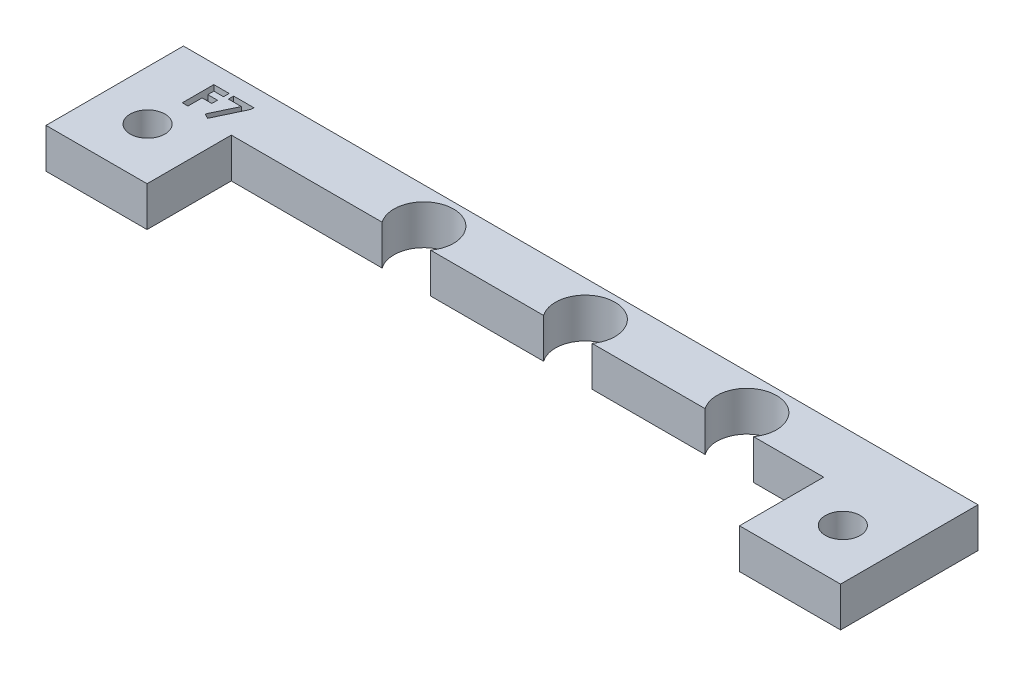
ISO-10303-21;
HEADER;
FILE_DESCRIPTION(('STEP AP214'),'2;1');
FILE_NAME('part.step','',(''),(''),'','','');
FILE_SCHEMA(('AUTOMOTIVE_DESIGN { 1 0 10303 214 1 1 1 1 }'));
ENDSEC;
DATA;
#1=APPLICATION_CONTEXT('core data for automotive mechanical design processes');
#2=APPLICATION_PROTOCOL_DEFINITION('international standard','automotive_design',2000,#1);
#3=PRODUCT_CONTEXT('',#1,'mechanical');
#4=PRODUCT('Part','Part','',(#3));
#5=PRODUCT_RELATED_PRODUCT_CATEGORY('part','',(#4));
#6=PRODUCT_DEFINITION_FORMATION('','',#4);
#7=PRODUCT_DEFINITION_CONTEXT('part definition',#1,'design');
#8=PRODUCT_DEFINITION('design','',#6,#7);
#9=PRODUCT_DEFINITION_SHAPE('','',#8);
#10=(LENGTH_UNIT() NAMED_UNIT(*) SI_UNIT(.MILLI.,.METRE.));
#11=(NAMED_UNIT(*) PLANE_ANGLE_UNIT() SI_UNIT($,.RADIAN.));
#12=(NAMED_UNIT(*) SI_UNIT($,.STERADIAN.) SOLID_ANGLE_UNIT());
#13=UNCERTAINTY_MEASURE_WITH_UNIT(LENGTH_MEASURE(1.E-05),#10,'distance_accuracy_value','');
#14=(GEOMETRIC_REPRESENTATION_CONTEXT(3) GLOBAL_UNCERTAINTY_ASSIGNED_CONTEXT((#13)) GLOBAL_UNIT_ASSIGNED_CONTEXT((#10,
#11,#12)) REPRESENTATION_CONTEXT('',''));
#15=CARTESIAN_POINT('',(0.,0.,0.));
#16=DIRECTION('',(0.,0.,1.));
#17=DIRECTION('',(1.,0.,0.));
#18=AXIS2_PLACEMENT_3D('',#15,#16,#17);
#19=CARTESIAN_POINT('',(0.,4.,0.));
#20=DIRECTION('',(0.,1.,0.));
#21=DIRECTION('',(0.,0.,1.));
#22=AXIS2_PLACEMENT_3D('',#19,#20,#21);
#23=PLANE('',#22);
#24=DIRECTION('',(1.,0.,0.));
#25=VECTOR('',#24,1.);
#26=CARTESIAN_POINT('',(0.,4.,10.3374425396582));
#27=LINE('',#26,#25);
#28=CARTESIAN_POINT('',(25.1964746150227,4.,10.3374425396582));
#29=VERTEX_POINT('',#28);
#30=CARTESIAN_POINT('',(36.5830777496134,4.,10.3374425396582));
#31=VERTEX_POINT('',#30);
#32=EDGE_CURVE('E355',#29,#31,#27,.T.);
#33=ORIENTED_EDGE('',*,*,#32,.T.);
#34=CARTESIAN_POINT('',(39.0197761823179,4.,8.58744232592804));
#35=DIRECTION('',(0.,1.,0.));
#36=DIRECTION('',(0.,0.,1.));
#37=AXIS2_PLACEMENT_3D('',#34,#35,#36);
#38=CIRCLE('',#37,3.);
#39=CARTESIAN_POINT('',(41.4564746150223,4.,10.3374425396582));
#40=VERTEX_POINT('',#39);
#41=EDGE_CURVE('E358',#40,#31,#38,.T.);
#42=ORIENTED_EDGE('',*,*,#41,.F.);
#43=DIRECTION('',(1.,0.,0.));
#44=VECTOR('',#43,1.);
#45=CARTESIAN_POINT('',(0.,4.,10.3374425396582));
#46=LINE('',#45,#44);
#47=CARTESIAN_POINT('',(48.5197761823179,4.,10.3374425396582));
#48=VERTEX_POINT('',#47);
#49=EDGE_CURVE('E363',#40,#48,#46,.T.);
#50=ORIENTED_EDGE('',*,*,#49,.T.);
#51=DIRECTION('',(0.,0.,-1.));
#52=VECTOR('',#51,1.);
#53=CARTESIAN_POINT('',(48.5197761823179,4.,0.));
#54=LINE('',#53,#52);
#55=CARTESIAN_POINT('',(48.5197761823179,4.,18.8163166195389));
#56=VERTEX_POINT('',#55);
#57=EDGE_CURVE('E366',#56,#48,#54,.T.);
#58=ORIENTED_EDGE('',*,*,#57,.F.);
#59=DIRECTION('',(1.,0.,0.));
#60=VECTOR('',#59,1.);
#61=CARTESIAN_POINT('',(0.,4.,18.8163166195389));
#62=LINE('',#61,#60);
#63=CARTESIAN_POINT('',(58.6947761823179,4.,18.8163166195389));
#64=VERTEX_POINT('',#63);
#65=EDGE_CURVE('E370',#56,#64,#62,.T.);
#66=ORIENTED_EDGE('',*,*,#65,.T.);
#67=DIRECTION('',(0.,0.,1.));
#68=VECTOR('',#67,1.);
#69=CARTESIAN_POINT('',(58.6947761823179,4.,0.));
#70=LINE('',#69,#68);
#71=CARTESIAN_POINT('',(58.6947761823179,4.,4.97792171139708));
#72=VERTEX_POINT('',#71);
#73=EDGE_CURVE('E373',#72,#64,#70,.T.);
#74=ORIENTED_EDGE('',*,*,#73,.F.);
#75=DIRECTION('',(1.,0.,0.));
#76=VECTOR('',#75,1.);
#77=CARTESIAN_POINT('',(0.,4.,4.97792171139708));
#78=LINE('',#77,#76);
#79=CARTESIAN_POINT('',(-21.3052238176821,4.,4.97792171139708));
#80=VERTEX_POINT('',#79);
#81=EDGE_CURVE('E377',#80,#72,#78,.T.);
#82=ORIENTED_EDGE('',*,*,#81,.F.);
#83=DIRECTION('',(0.,0.,-1.));
#84=VECTOR('',#83,1.);
#85=CARTESIAN_POINT('',(-21.3052238176821,4.,0.));
#86=LINE('',#85,#84);
#87=CARTESIAN_POINT('',(-21.3052238176821,4.,18.8163166195389));
#88=VERTEX_POINT('',#87);
#89=EDGE_CURVE('E381',#88,#80,#86,.T.);
#90=ORIENTED_EDGE('',*,*,#89,.F.);
#91=DIRECTION('',(1.,0.,0.));
#92=VECTOR('',#91,1.);
#93=CARTESIAN_POINT('',(0.,4.,18.8163166195389));
#94=LINE('',#93,#92);
#95=CARTESIAN_POINT('',(-11.1302238176834,4.,18.8163166195389));
#96=VERTEX_POINT('',#95);
#97=EDGE_CURVE('E385',#88,#96,#94,.T.);
#98=ORIENTED_EDGE('',*,*,#97,.T.);
#99=DIRECTION('',(0.,0.,1.));
#100=VECTOR('',#99,1.);
#101=CARTESIAN_POINT('',(-11.1302238176836,4.,0.));
#102=LINE('',#101,#100);
#103=CARTESIAN_POINT('',(-11.1302238176835,4.,10.3374425396582));
#104=VERTEX_POINT('',#103);
#105=EDGE_CURVE('E388',#104,#96,#102,.T.);
#106=ORIENTED_EDGE('',*,*,#105,.F.);
#107=DIRECTION('',(1.,0.,0.));
#108=VECTOR('',#107,1.);
#109=CARTESIAN_POINT('',(0.,4.,10.3374425396582));
#110=LINE('',#109,#108);
#111=CARTESIAN_POINT('',(4.06307774961151,4.,10.3374425396582));
#112=VERTEX_POINT('',#111);
#113=EDGE_CURVE('E392',#104,#112,#110,.T.);
#114=ORIENTED_EDGE('',*,*,#113,.T.);
#115=CARTESIAN_POINT('',(6.49977618231591,4.,8.58744232592797));
#116=DIRECTION('',(0.,1.,0.));
#117=DIRECTION('',(0.,0.,1.));
#118=AXIS2_PLACEMENT_3D('',#115,#116,#117);
#119=CIRCLE('',#118,3.);
#120=CARTESIAN_POINT('',(8.9364746150203,4.,10.3374425396582));
#121=VERTEX_POINT('',#120);
#122=EDGE_CURVE('E395',#121,#112,#119,.T.);
#123=ORIENTED_EDGE('',*,*,#122,.F.);
#124=DIRECTION('',(1.,0.,0.));
#125=VECTOR('',#124,1.);
#126=CARTESIAN_POINT('',(0.,4.,10.3374425396582));
#127=LINE('',#126,#125);
#128=CARTESIAN_POINT('',(20.3230777496139,4.,10.3374425396582));
#129=VERTEX_POINT('',#128);
#130=EDGE_CURVE('E399',#121,#129,#127,.T.);
#131=ORIENTED_EDGE('',*,*,#130,.T.);
#132=CARTESIAN_POINT('',(22.7597761823183,4.,8.58744232592797));
#133=DIRECTION('',(0.,1.,0.));
#134=DIRECTION('',(0.,0.,1.));
#135=AXIS2_PLACEMENT_3D('',#132,#133,#134);
#136=CIRCLE('',#135,3.);
#137=EDGE_CURVE('E402',#29,#129,#136,.T.);
#138=ORIENTED_EDGE('',*,*,#137,.F.);
#139=EDGE_LOOP('',(#33,#42,#50,#58,#66,#74,#82,#90,#98,#106,#114,#123,#131,#138));
#140=FACE_BOUND('',#139,.T.);
#141=CARTESIAN_POINT('',(53.6947761823179,4.,13.5874424327929));
#142=DIRECTION('',(0.,1.,0.));
#143=DIRECTION('',(0.,0.,1.));
#144=AXIS2_PLACEMENT_3D('',#141,#142,#143);
#145=CIRCLE('',#144,1.75);
#146=CARTESIAN_POINT('',(53.6947761823179,4.,15.3374424327929));
#147=VERTEX_POINT('',#146);
#148=EDGE_CURVE('E406',#147,#147,#145,.T.);
#149=ORIENTED_EDGE('',*,*,#148,.F.);
#150=EDGE_LOOP('',(#149));
#151=FACE_BOUND('',#150,.T.);
#152=CARTESIAN_POINT('',(-16.3052238176821,4.,13.587442432793));
#153=DIRECTION('',(0.,1.,0.));
#154=DIRECTION('',(0.,0.,1.));
#155=AXIS2_PLACEMENT_3D('',#152,#153,#154);
#156=CIRCLE('',#155,1.75);
#157=CARTESIAN_POINT('',(-16.3052238176821,4.,15.337442432793));
#158=VERTEX_POINT('',#157);
#159=EDGE_CURVE('E410',#158,#158,#156,.T.);
#160=ORIENTED_EDGE('',*,*,#159,.F.);
#161=EDGE_LOOP('',(#160));
#162=FACE_BOUND('',#161,.T.);
#163=DIRECTION('',(-1.,0.,0.));
#164=VECTOR('',#163,1.);
#165=CARTESIAN_POINT('',(-13.1174110061835,4.,7.3416332605224));
#166=LINE('',#165,#164);
#167=CARTESIAN_POINT('',(-13.1174110061835,4.,7.3416332605224));
#168=VERTEX_POINT('',#167);
#169=CARTESIAN_POINT('',(-14.4174310382347,4.,7.3416332605224));
#170=VERTEX_POINT('',#169);
#171=EDGE_CURVE('E308',#168,#170,#166,.T.);
#172=ORIENTED_EDGE('',*,*,#171,.T.);
#173=DIRECTION('',(0.,0.,-1.));
#174=VECTOR('',#173,1.);
#175=CARTESIAN_POINT('',(-14.4174310382347,4.,7.3416332605224));
#176=LINE('',#175,#174);
#177=CARTESIAN_POINT('',(-14.4174310382347,4.,6.81246659385574));
#178=VERTEX_POINT('',#177);
#179=EDGE_CURVE('E69',#170,#178,#176,.T.);
#180=ORIENTED_EDGE('',*,*,#179,.T.);
#181=DIRECTION('',(1.,0.,0.));
#182=VECTOR('',#181,1.);
#183=CARTESIAN_POINT('',(-14.4174310382347,4.,6.81246659385574));
#184=LINE('',#183,#182);
#185=CARTESIAN_POINT('',(-12.3821746279783,4.,6.81246659385574));
#186=VERTEX_POINT('',#185);
#187=EDGE_CURVE('E329',#178,#186,#184,.T.);
#188=ORIENTED_EDGE('',*,*,#187,.T.);
#189=DIRECTION('',(0.,0.,1.));
#190=VECTOR('',#189,1.);
#191=CARTESIAN_POINT('',(-12.3821746279783,4.,6.81246659385574));
#192=LINE('',#191,#190);
#193=CARTESIAN_POINT('',(-12.3821746279783,4.,7.10821479097112));
#194=VERTEX_POINT('',#193);
#195=EDGE_CURVE('E325',#186,#194,#192,.T.);
#196=ORIENTED_EDGE('',*,*,#195,.T.);
#197=DIRECTION('',(-0.427610471419761,0.,0.903963099209348));
#198=VECTOR('',#197,1.);
#199=CARTESIAN_POINT('',(-12.3821746279783,4.,7.10821479097112));
#200=LINE('',#199,#198);
#201=CARTESIAN_POINT('',(-13.782685445286,4.,10.068876850266));
#202=VERTEX_POINT('',#201);
#203=EDGE_CURVE('E321',#194,#202,#200,.T.);
#204=ORIENTED_EDGE('',*,*,#203,.T.);
#205=DIRECTION('',(-0.892845363411199,0.,-0.45036336111536));
#206=VECTOR('',#205,1.);
#207=CARTESIAN_POINT('',(-13.782685445286,4.,10.068876850266));
#208=LINE('',#207,#206);
#209=CARTESIAN_POINT('',(-14.2870474244527,4.,9.81446979898394));
#210=VERTEX_POINT('',#209);
#211=EDGE_CURVE('E317',#202,#210,#208,.T.);
#212=ORIENTED_EDGE('',*,*,#211,.T.);
#213=DIRECTION('',(0.427576554316682,0.,-0.903979142568386));
#214=VECTOR('',#213,1.);
#215=CARTESIAN_POINT('',(-14.2870474244527,4.,9.81446979898394));
#216=LINE('',#215,#214);
#217=EDGE_CURVE('E312',#210,#168,#216,.T.);
#218=ORIENTED_EDGE('',*,*,#217,.T.);
#219=EDGE_LOOP('',(#172,#180,#188,#196,#204,#212,#218));
#220=FACE_BOUND('',#219,.T.);
#221=DIRECTION('',(-1.,0.,0.));
#222=VECTOR('',#221,1.);
#223=CARTESIAN_POINT('',(-15.8421105254142,4.,9.98746659385574));
#224=LINE('',#223,#222);
#225=CARTESIAN_POINT('',(-15.8421105254142,4.,9.98746659385574));
#226=VERTEX_POINT('',#225);
#227=CARTESIAN_POINT('',(-16.411982320286,4.,9.98746659385574));
#228=VERTEX_POINT('',#227);
#229=EDGE_CURVE('E268',#226,#228,#224,.T.);
#230=ORIENTED_EDGE('',*,*,#229,.T.);
#231=DIRECTION('',(0.,0.,-1.));
#232=VECTOR('',#231,1.);
#233=CARTESIAN_POINT('',(-16.411982320286,4.,9.98746659385574));
#234=LINE('',#233,#232);
#235=CARTESIAN_POINT('',(-16.411982320286,4.,6.81246659385574));
#236=VERTEX_POINT('',#235);
#237=EDGE_CURVE('E61',#228,#236,#234,.T.);
#238=ORIENTED_EDGE('',*,*,#237,.T.);
#239=DIRECTION('',(1.,0.,0.));
#240=VECTOR('',#239,1.);
#241=CARTESIAN_POINT('',(-16.411982320286,4.,6.81246659385574));
#242=LINE('',#241,#240);
#243=CARTESIAN_POINT('',(-14.8651874484912,4.,6.81246659385574));
#244=VERTEX_POINT('',#243);
#245=EDGE_CURVE('E272',#236,#244,#242,.T.);
#246=ORIENTED_EDGE('',*,*,#245,.T.);
#247=DIRECTION('',(0.,0.,1.));
#248=VECTOR('',#247,1.);
#249=CARTESIAN_POINT('',(-14.8651874484912,4.,6.81246659385574));
#250=LINE('',#249,#248);
#251=CARTESIAN_POINT('',(-14.8651874484912,4.,7.38233838872753));
#252=VERTEX_POINT('',#251);
#253=EDGE_CURVE('E624',#244,#252,#250,.T.);
#254=ORIENTED_EDGE('',*,*,#253,.T.);
#255=DIRECTION('',(-1.,0.,0.));
#256=VECTOR('',#255,1.);
#257=CARTESIAN_POINT('',(-14.8651874484912,4.,7.38233838872753));
#258=LINE('',#257,#256);
#259=CARTESIAN_POINT('',(-15.8421105254142,4.,7.38233838872753));
#260=VERTEX_POINT('',#259);
#261=EDGE_CURVE('E627',#252,#260,#258,.T.);
#262=ORIENTED_EDGE('',*,*,#261,.T.);
#263=DIRECTION('',(0.,0.,1.));
#264=VECTOR('',#263,1.);
#265=CARTESIAN_POINT('',(-15.8421105254142,4.,7.38233838872753));
#266=LINE('',#265,#264);
#267=CARTESIAN_POINT('',(-15.8421105254142,4.,7.99291531180445));
#268=VERTEX_POINT('',#267);
#269=EDGE_CURVE('E633',#260,#268,#266,.T.);
#270=ORIENTED_EDGE('',*,*,#269,.T.);
#271=DIRECTION('',(1.,0.,0.));
#272=VECTOR('',#271,1.);
#273=CARTESIAN_POINT('',(-15.8421105254142,4.,7.99291531180445));
#274=LINE('',#273,#272);
#275=CARTESIAN_POINT('',(-14.8651874484912,4.,7.99291531180445));
#276=VERTEX_POINT('',#275);
#277=EDGE_CURVE('E643',#268,#276,#274,.T.);
#278=ORIENTED_EDGE('',*,*,#277,.T.);
#279=DIRECTION('',(0.,0.,1.));
#280=VECTOR('',#279,1.);
#281=CARTESIAN_POINT('',(-14.8651874484912,4.,7.99291531180445));
#282=LINE('',#281,#280);
#283=CARTESIAN_POINT('',(-14.8651874484912,4.,8.56278710667625));
#284=VERTEX_POINT('',#283);
#285=EDGE_CURVE('E647',#276,#284,#282,.T.);
#286=ORIENTED_EDGE('',*,*,#285,.T.);
#287=DIRECTION('',(-1.,0.,0.));
#288=VECTOR('',#287,1.);
#289=CARTESIAN_POINT('',(-14.8651874484912,4.,8.56278710667625));
#290=LINE('',#289,#288);
#291=CARTESIAN_POINT('',(-15.8421105254142,4.,8.56278710667625));
#292=VERTEX_POINT('',#291);
#293=EDGE_CURVE('E593',#284,#292,#290,.T.);
#294=ORIENTED_EDGE('',*,*,#293,.T.);
#295=DIRECTION('',(0.,0.,1.));
#296=VECTOR('',#295,1.);
#297=CARTESIAN_POINT('',(-15.8421105254142,4.,8.56278710667625));
#298=LINE('',#297,#296);
#299=EDGE_CURVE('E587',#292,#226,#298,.T.);
#300=ORIENTED_EDGE('',*,*,#299,.T.);
#301=EDGE_LOOP('',(#230,#238,#246,#254,#262,#270,#278,#286,#294,#300));
#302=FACE_BOUND('',#301,.T.);
#303=ADVANCED_FACE('F45',(#140,#151,#162,#220,#302),#23,.T.);
#304=CARTESIAN_POINT('',(0.,4.,10.3374425396582));
#305=DIRECTION('',(0.,0.,-1.));
#306=DIRECTION('',(-1.,0.,0.));
#307=AXIS2_PLACEMENT_3D('',#304,#305,#306);
#308=PLANE('',#307);
#309=DIRECTION('',(1.,0.,0.));
#310=VECTOR('',#309,1.);
#311=CARTESIAN_POINT('',(0.,0.,10.3374425396582));
#312=LINE('',#311,#310);
#313=CARTESIAN_POINT('',(25.1964746150227,0.,10.3374425396582));
#314=VERTEX_POINT('',#313);
#315=CARTESIAN_POINT('',(36.5830777496134,0.,10.3374425396582));
#316=VERTEX_POINT('',#315);
#317=EDGE_CURVE('E274',#314,#316,#312,.T.);
#318=ORIENTED_EDGE('',*,*,#317,.T.);
#319=DIRECTION('',(0.,-1.,0.));
#320=VECTOR('',#319,1.);
#321=CARTESIAN_POINT('',(36.5830777496134,4.,10.3374425396582));
#322=LINE('',#321,#320);
#323=EDGE_CURVE('E11',#31,#316,#322,.T.);
#324=ORIENTED_EDGE('',*,*,#323,.F.);
#325=ORIENTED_EDGE('',*,*,#32,.F.);
#326=DIRECTION('',(0.,-1.,0.));
#327=VECTOR('',#326,1.);
#328=CARTESIAN_POINT('',(25.1964746150227,4.,10.3374425396582));
#329=LINE('',#328,#327);
#330=EDGE_CURVE('E413',#29,#314,#329,.T.);
#331=ORIENTED_EDGE('',*,*,#330,.T.);
#332=EDGE_LOOP('',(#318,#324,#325,#331));
#333=FACE_BOUND('',#332,.T.);
#334=ADVANCED_FACE('F47',(#333),#308,.F.);
#335=CARTESIAN_POINT('',(39.0197761823179,4.,8.58744232592804));
#336=DIRECTION('',(0.,-1.,0.));
#337=DIRECTION('',(0.,0.,-1.));
#338=AXIS2_PLACEMENT_3D('',#335,#336,#337);
#339=CYLINDRICAL_SURFACE('',#338,3.);
#340=CARTESIAN_POINT('',(39.0197761823179,0.,8.58744232592804));
#341=DIRECTION('',(0.,1.,0.));
#342=DIRECTION('',(0.,0.,1.));
#343=AXIS2_PLACEMENT_3D('',#340,#341,#342);
#344=CIRCLE('',#343,3.);
#345=CARTESIAN_POINT('',(41.4564746150223,0.,10.3374425396582));
#346=VERTEX_POINT('',#345);
#347=EDGE_CURVE('E280',#346,#316,#344,.T.);
#348=ORIENTED_EDGE('',*,*,#347,.F.);
#349=DIRECTION('',(0.,-1.,0.));
#350=VECTOR('',#349,1.);
#351=CARTESIAN_POINT('',(41.4564746150223,4.,10.3374425396582));
#352=LINE('',#351,#350);
#353=EDGE_CURVE('E54',#40,#346,#352,.T.);
#354=ORIENTED_EDGE('',*,*,#353,.F.);
#355=ORIENTED_EDGE('',*,*,#41,.T.);
#356=ORIENTED_EDGE('',*,*,#323,.T.);
#357=EDGE_LOOP('',(#348,#354,#355,#356));
#358=FACE_BOUND('',#357,.T.);
#359=ADVANCED_FACE('F522',(#358),#339,.F.);
#360=CARTESIAN_POINT('',(0.,4.,10.3374425396582));
#361=DIRECTION('',(0.,0.,-1.));
#362=DIRECTION('',(-1.,0.,0.));
#363=AXIS2_PLACEMENT_3D('',#360,#361,#362);
#364=PLANE('',#363);
#365=DIRECTION('',(1.,0.,0.));
#366=VECTOR('',#365,1.);
#367=CARTESIAN_POINT('',(0.,0.,10.3374425396582));
#368=LINE('',#367,#366);
#369=CARTESIAN_POINT('',(48.5197761823179,0.,10.3374425396582));
#370=VERTEX_POINT('',#369);
#371=EDGE_CURVE('E418',#346,#370,#368,.T.);
#372=ORIENTED_EDGE('',*,*,#371,.T.);
#373=DIRECTION('',(0.,-1.,0.));
#374=VECTOR('',#373,1.);
#375=CARTESIAN_POINT('',(48.5197761823179,4.,10.3374425396582));
#376=LINE('',#375,#374);
#377=EDGE_CURVE('E505',#48,#370,#376,.T.);
#378=ORIENTED_EDGE('',*,*,#377,.F.);
#379=ORIENTED_EDGE('',*,*,#49,.F.);
#380=ORIENTED_EDGE('',*,*,#353,.T.);
#381=EDGE_LOOP('',(#372,#378,#379,#380));
#382=FACE_BOUND('',#381,.T.);
#383=ADVANCED_FACE('F511',(#382),#364,.F.);
#384=CARTESIAN_POINT('',(48.5197761823179,4.,0.));
#385=DIRECTION('',(-1.,0.,0.));
#386=DIRECTION('',(0.,0.,1.));
#387=AXIS2_PLACEMENT_3D('',#384,#385,#386);
#388=PLANE('',#387);
#389=DIRECTION('',(0.,0.,-1.));
#390=VECTOR('',#389,1.);
#391=CARTESIAN_POINT('',(48.5197761823179,0.,0.));
#392=LINE('',#391,#390);
#393=CARTESIAN_POINT('',(48.5197761823179,0.,18.8163166195389));
#394=VERTEX_POINT('',#393);
#395=EDGE_CURVE('E422',#394,#370,#392,.T.);
#396=ORIENTED_EDGE('',*,*,#395,.F.);
#397=DIRECTION('',(0.,-1.,0.));
#398=VECTOR('',#397,1.);
#399=CARTESIAN_POINT('',(48.5197761823179,4.,18.8163166195389));
#400=LINE('',#399,#398);
#401=EDGE_CURVE('E502',#56,#394,#400,.T.);
#402=ORIENTED_EDGE('',*,*,#401,.F.);
#403=ORIENTED_EDGE('',*,*,#57,.T.);
#404=ORIENTED_EDGE('',*,*,#377,.T.);
#405=EDGE_LOOP('',(#396,#402,#403,#404));
#406=FACE_BOUND('',#405,.T.);
#407=ADVANCED_FACE('F571',(#406),#388,.T.);
#408=CARTESIAN_POINT('',(0.,4.,18.8163166195389));
#409=DIRECTION('',(0.,0.,-1.));
#410=DIRECTION('',(-1.,0.,0.));
#411=AXIS2_PLACEMENT_3D('',#408,#409,#410);
#412=PLANE('',#411);
#413=DIRECTION('',(1.,0.,0.));
#414=VECTOR('',#413,1.);
#415=CARTESIAN_POINT('',(0.,0.,18.8163166195389));
#416=LINE('',#415,#414);
#417=CARTESIAN_POINT('',(58.6947761823179,0.,18.8163166195389));
#418=VERTEX_POINT('',#417);
#419=EDGE_CURVE('E426',#394,#418,#416,.T.);
#420=ORIENTED_EDGE('',*,*,#419,.T.);
#421=DIRECTION('',(0.,-1.,0.));
#422=VECTOR('',#421,1.);
#423=CARTESIAN_POINT('',(58.6947761823179,4.,18.8163166195389));
#424=LINE('',#423,#422);
#425=EDGE_CURVE('E499',#64,#418,#424,.T.);
#426=ORIENTED_EDGE('',*,*,#425,.F.);
#427=ORIENTED_EDGE('',*,*,#65,.F.);
#428=ORIENTED_EDGE('',*,*,#401,.T.);
#429=EDGE_LOOP('',(#420,#426,#427,#428));
#430=FACE_BOUND('',#429,.T.);
#431=ADVANCED_FACE('F568',(#430),#412,.F.);
#432=CARTESIAN_POINT('',(58.6947761823179,4.,0.));
#433=DIRECTION('',(1.,0.,0.));
#434=DIRECTION('',(0.,0.,-1.));
#435=AXIS2_PLACEMENT_3D('',#432,#433,#434);
#436=PLANE('',#435);
#437=DIRECTION('',(0.,0.,1.));
#438=VECTOR('',#437,1.);
#439=CARTESIAN_POINT('',(58.6947761823179,0.,0.));
#440=LINE('',#439,#438);
#441=CARTESIAN_POINT('',(58.6947761823179,0.,4.97792171139708));
#442=VERTEX_POINT('',#441);
#443=EDGE_CURVE('E430',#442,#418,#440,.T.);
#444=ORIENTED_EDGE('',*,*,#443,.F.);
#445=DIRECTION('',(0.,-1.,0.));
#446=VECTOR('',#445,1.);
#447=CARTESIAN_POINT('',(58.6947761823179,4.,4.97792171139708));
#448=LINE('',#447,#446);
#449=EDGE_CURVE('E496',#72,#442,#448,.T.);
#450=ORIENTED_EDGE('',*,*,#449,.F.);
#451=ORIENTED_EDGE('',*,*,#73,.T.);
#452=ORIENTED_EDGE('',*,*,#425,.T.);
#453=EDGE_LOOP('',(#444,#450,#451,#452));
#454=FACE_BOUND('',#453,.T.);
#455=ADVANCED_FACE('F563',(#454),#436,.T.);
#456=CARTESIAN_POINT('',(0.,4.,4.97792171139708));
#457=DIRECTION('',(0.,0.,-1.));
#458=DIRECTION('',(-1.,0.,0.));
#459=AXIS2_PLACEMENT_3D('',#456,#457,#458);
#460=PLANE('',#459);
#461=DIRECTION('',(1.,0.,0.));
#462=VECTOR('',#461,1.);
#463=CARTESIAN_POINT('',(0.,0.,4.97792171139708));
#464=LINE('',#463,#462);
#465=CARTESIAN_POINT('',(-21.3052238176821,0.,4.97792171139708));
#466=VERTEX_POINT('',#465);
#467=EDGE_CURVE('E434',#466,#442,#464,.T.);
#468=ORIENTED_EDGE('',*,*,#467,.F.);
#469=DIRECTION('',(0.,-1.,0.));
#470=VECTOR('',#469,1.);
#471=CARTESIAN_POINT('',(-21.3052238176821,4.,4.97792171139708));
#472=LINE('',#471,#470);
#473=EDGE_CURVE('E493',#80,#466,#472,.T.);
#474=ORIENTED_EDGE('',*,*,#473,.F.);
#475=ORIENTED_EDGE('',*,*,#81,.T.);
#476=ORIENTED_EDGE('',*,*,#449,.T.);
#477=EDGE_LOOP('',(#468,#474,#475,#476));
#478=FACE_BOUND('',#477,.T.);
#479=ADVANCED_FACE('F560',(#478),#460,.T.);
#480=CARTESIAN_POINT('',(-21.3052238176821,4.,0.));
#481=DIRECTION('',(-1.,0.,0.));
#482=DIRECTION('',(0.,0.,1.));
#483=AXIS2_PLACEMENT_3D('',#480,#481,#482);
#484=PLANE('',#483);
#485=DIRECTION('',(0.,0.,-1.));
#486=VECTOR('',#485,1.);
#487=CARTESIAN_POINT('',(-21.3052238176821,0.,0.));
#488=LINE('',#487,#486);
#489=CARTESIAN_POINT('',(-21.3052238176821,0.,18.8163166195389));
#490=VERTEX_POINT('',#489);
#491=EDGE_CURVE('E438',#490,#466,#488,.T.);
#492=ORIENTED_EDGE('',*,*,#491,.F.);
#493=DIRECTION('',(0.,-1.,0.));
#494=VECTOR('',#493,1.);
#495=CARTESIAN_POINT('',(-21.3052238176821,4.,18.8163166195389));
#496=LINE('',#495,#494);
#497=EDGE_CURVE('E490',#88,#490,#496,.T.);
#498=ORIENTED_EDGE('',*,*,#497,.F.);
#499=ORIENTED_EDGE('',*,*,#89,.T.);
#500=ORIENTED_EDGE('',*,*,#473,.T.);
#501=EDGE_LOOP('',(#492,#498,#499,#500));
#502=FACE_BOUND('',#501,.T.);
#503=ADVANCED_FACE('F555',(#502),#484,.T.);
#504=CARTESIAN_POINT('',(0.,4.,18.8163166195389));
#505=DIRECTION('',(0.,0.,-1.));
#506=DIRECTION('',(-1.,0.,0.));
#507=AXIS2_PLACEMENT_3D('',#504,#505,#506);
#508=PLANE('',#507);
#509=DIRECTION('',(1.,0.,0.));
#510=VECTOR('',#509,1.);
#511=CARTESIAN_POINT('',(0.,0.,18.8163166195389));
#512=LINE('',#511,#510);
#513=CARTESIAN_POINT('',(-11.1302238176834,0.,18.8163166195389));
#514=VERTEX_POINT('',#513);
#515=EDGE_CURVE('E442',#490,#514,#512,.T.);
#516=ORIENTED_EDGE('',*,*,#515,.T.);
#517=DIRECTION('',(0.,-1.,0.));
#518=VECTOR('',#517,1.);
#519=CARTESIAN_POINT('',(-11.1302238176834,4.,18.8163166195389));
#520=LINE('',#519,#518);
#521=EDGE_CURVE('E487',#96,#514,#520,.T.);
#522=ORIENTED_EDGE('',*,*,#521,.F.);
#523=ORIENTED_EDGE('',*,*,#97,.F.);
#524=ORIENTED_EDGE('',*,*,#497,.T.);
#525=EDGE_LOOP('',(#516,#522,#523,#524));
#526=FACE_BOUND('',#525,.T.);
#527=ADVANCED_FACE('F552',(#526),#508,.F.);
#528=CARTESIAN_POINT('',(-11.1302238176836,4.,0.));
#529=DIRECTION('',(1.,0.,0.));
#530=DIRECTION('',(0.,0.,-1.));
#531=AXIS2_PLACEMENT_3D('',#528,#529,#530);
#532=PLANE('',#531);
#533=DIRECTION('',(0.,0.,1.));
#534=VECTOR('',#533,1.);
#535=CARTESIAN_POINT('',(-11.1302238176836,0.,0.));
#536=LINE('',#535,#534);
#537=CARTESIAN_POINT('',(-11.1302238176835,0.,10.3374425396582));
#538=VERTEX_POINT('',#537);
#539=EDGE_CURVE('E446',#538,#514,#536,.T.);
#540=ORIENTED_EDGE('',*,*,#539,.F.);
#541=DIRECTION('',(0.,-1.,0.));
#542=VECTOR('',#541,1.);
#543=CARTESIAN_POINT('',(-11.1302238176835,4.,10.3374425396582));
#544=LINE('',#543,#542);
#545=EDGE_CURVE('E484',#104,#538,#544,.T.);
#546=ORIENTED_EDGE('',*,*,#545,.F.);
#547=ORIENTED_EDGE('',*,*,#105,.T.);
#548=ORIENTED_EDGE('',*,*,#521,.T.);
#549=EDGE_LOOP('',(#540,#546,#547,#548));
#550=FACE_BOUND('',#549,.T.);
#551=ADVANCED_FACE('F547',(#550),#532,.T.);
#552=CARTESIAN_POINT('',(0.,4.,10.3374425396582));
#553=DIRECTION('',(0.,0.,-1.));
#554=DIRECTION('',(-1.,0.,0.));
#555=AXIS2_PLACEMENT_3D('',#552,#553,#554);
#556=PLANE('',#555);
#557=DIRECTION('',(1.,0.,0.));
#558=VECTOR('',#557,1.);
#559=CARTESIAN_POINT('',(0.,0.,10.3374425396582));
#560=LINE('',#559,#558);
#561=CARTESIAN_POINT('',(4.06307774961151,0.,10.3374425396582));
#562=VERTEX_POINT('',#561);
#563=EDGE_CURVE('E450',#538,#562,#560,.T.);
#564=ORIENTED_EDGE('',*,*,#563,.T.);
#565=DIRECTION('',(0.,-1.,0.));
#566=VECTOR('',#565,1.);
#567=CARTESIAN_POINT('',(4.06307774961151,4.,10.3374425396582));
#568=LINE('',#567,#566);
#569=EDGE_CURVE('E481',#112,#562,#568,.T.);
#570=ORIENTED_EDGE('',*,*,#569,.F.);
#571=ORIENTED_EDGE('',*,*,#113,.F.);
#572=ORIENTED_EDGE('',*,*,#545,.T.);
#573=EDGE_LOOP('',(#564,#570,#571,#572));
#574=FACE_BOUND('',#573,.T.);
#575=ADVANCED_FACE('F543',(#574),#556,.F.);
#576=CARTESIAN_POINT('',(6.49977618231591,4.,8.58744232592797));
#577=DIRECTION('',(0.,-1.,0.));
#578=DIRECTION('',(0.,0.,-1.));
#579=AXIS2_PLACEMENT_3D('',#576,#577,#578);
#580=CYLINDRICAL_SURFACE('',#579,3.);
#581=CARTESIAN_POINT('',(6.49977618231591,0.,8.58744232592797));
#582=DIRECTION('',(0.,1.,0.));
#583=DIRECTION('',(0.,0.,1.));
#584=AXIS2_PLACEMENT_3D('',#581,#582,#583);
#585=CIRCLE('',#584,3.);
#586=CARTESIAN_POINT('',(8.9364746150203,0.,10.3374425396582));
#587=VERTEX_POINT('',#586);
#588=EDGE_CURVE('E454',#587,#562,#585,.T.);
#589=ORIENTED_EDGE('',*,*,#588,.F.);
#590=DIRECTION('',(0.,-1.,0.));
#591=VECTOR('',#590,1.);
#592=CARTESIAN_POINT('',(8.9364746150203,4.,10.3374425396582));
#593=LINE('',#592,#591);
#594=EDGE_CURVE('E478',#121,#587,#593,.T.);
#595=ORIENTED_EDGE('',*,*,#594,.F.);
#596=ORIENTED_EDGE('',*,*,#122,.T.);
#597=ORIENTED_EDGE('',*,*,#569,.T.);
#598=EDGE_LOOP('',(#589,#595,#596,#597));
#599=FACE_BOUND('',#598,.T.);
#600=ADVANCED_FACE('F538',(#599),#580,.F.);
#601=CARTESIAN_POINT('',(0.,4.,10.3374425396582));
#602=DIRECTION('',(0.,0.,-1.));
#603=DIRECTION('',(-1.,0.,0.));
#604=AXIS2_PLACEMENT_3D('',#601,#602,#603);
#605=PLANE('',#604);
#606=DIRECTION('',(1.,0.,0.));
#607=VECTOR('',#606,1.);
#608=CARTESIAN_POINT('',(0.,0.,10.3374425396582));
#609=LINE('',#608,#607);
#610=CARTESIAN_POINT('',(20.3230777496139,0.,10.3374425396582));
#611=VERTEX_POINT('',#610);
#612=EDGE_CURVE('E458',#587,#611,#609,.T.);
#613=ORIENTED_EDGE('',*,*,#612,.T.);
#614=DIRECTION('',(0.,-1.,0.));
#615=VECTOR('',#614,1.);
#616=CARTESIAN_POINT('',(20.3230777496139,4.,10.3374425396582));
#617=LINE('',#616,#615);
#618=EDGE_CURVE('E475',#129,#611,#617,.T.);
#619=ORIENTED_EDGE('',*,*,#618,.F.);
#620=ORIENTED_EDGE('',*,*,#130,.F.);
#621=ORIENTED_EDGE('',*,*,#594,.T.);
#622=EDGE_LOOP('',(#613,#619,#620,#621));
#623=FACE_BOUND('',#622,.T.);
#624=ADVANCED_FACE('F534',(#623),#605,.F.);
#625=CARTESIAN_POINT('',(53.6947761823179,4.,13.5874424327929));
#626=DIRECTION('',(0.,-1.,0.));
#627=DIRECTION('',(0.,0.,-1.));
#628=AXIS2_PLACEMENT_3D('',#625,#626,#627);
#629=CYLINDRICAL_SURFACE('',#628,1.75);
#630=ORIENTED_EDGE('',*,*,#148,.T.);
#631=EDGE_LOOP('',(#630));
#632=FACE_BOUND('',#631,.T.);
#633=CARTESIAN_POINT('',(53.6947761823179,0.,13.5874424327929));
#634=DIRECTION('',(0.,1.,0.));
#635=DIRECTION('',(0.,0.,1.));
#636=AXIS2_PLACEMENT_3D('',#633,#634,#635);
#637=CIRCLE('',#636,1.75);
#638=CARTESIAN_POINT('',(53.6947761823179,0.,15.3374424327929));
#639=VERTEX_POINT('',#638);
#640=EDGE_CURVE('E466',#639,#639,#637,.T.);
#641=ORIENTED_EDGE('',*,*,#640,.F.);
#642=EDGE_LOOP('',(#641));
#643=FACE_BOUND('',#642,.T.);
#644=ADVANCED_FACE('F754',(#632,#643),#629,.F.);
#645=CARTESIAN_POINT('',(22.7597761823183,4.,8.58744232592797));
#646=DIRECTION('',(0.,-1.,0.));
#647=DIRECTION('',(0.,0.,-1.));
#648=AXIS2_PLACEMENT_3D('',#645,#646,#647);
#649=CYLINDRICAL_SURFACE('',#648,3.);
#650=CARTESIAN_POINT('',(22.7597761823183,0.,8.58744232592797));
#651=DIRECTION('',(0.,1.,0.));
#652=DIRECTION('',(0.,0.,1.));
#653=AXIS2_PLACEMENT_3D('',#650,#651,#652);
#654=CIRCLE('',#653,3.);
#655=EDGE_CURVE('E462',#314,#611,#654,.T.);
#656=ORIENTED_EDGE('',*,*,#655,.F.);
#657=ORIENTED_EDGE('',*,*,#330,.F.);
#658=ORIENTED_EDGE('',*,*,#137,.T.);
#659=ORIENTED_EDGE('',*,*,#618,.T.);
#660=EDGE_LOOP('',(#656,#657,#658,#659));
#661=FACE_BOUND('',#660,.T.);
#662=ADVANCED_FACE('F529',(#661),#649,.F.);
#663=CARTESIAN_POINT('',(-16.3052238176821,4.,13.587442432793));
#664=DIRECTION('',(0.,-1.,0.));
#665=DIRECTION('',(0.,0.,-1.));
#666=AXIS2_PLACEMENT_3D('',#663,#664,#665);
#667=CYLINDRICAL_SURFACE('',#666,1.75);
#668=ORIENTED_EDGE('',*,*,#159,.T.);
#669=EDGE_LOOP('',(#668));
#670=FACE_BOUND('',#669,.T.);
#671=CARTESIAN_POINT('',(-16.3052238176821,0.,13.587442432793));
#672=DIRECTION('',(0.,1.,0.));
#673=DIRECTION('',(0.,0.,1.));
#674=AXIS2_PLACEMENT_3D('',#671,#672,#673);
#675=CIRCLE('',#674,1.75);
#676=CARTESIAN_POINT('',(-16.3052238176821,0.,15.337442432793));
#677=VERTEX_POINT('',#676);
#678=EDGE_CURVE('E359',#677,#677,#675,.T.);
#679=ORIENTED_EDGE('',*,*,#678,.F.);
#680=EDGE_LOOP('',(#679));
#681=FACE_BOUND('',#680,.T.);
#682=ADVANCED_FACE('F750',(#670,#681),#667,.F.);
#683=CARTESIAN_POINT('',(0.,0.,0.));
#684=DIRECTION('',(0.,1.,0.));
#685=DIRECTION('',(0.,0.,1.));
#686=AXIS2_PLACEMENT_3D('',#683,#684,#685);
#687=PLANE('',#686);
#688=ORIENTED_EDGE('',*,*,#317,.F.);
#689=ORIENTED_EDGE('',*,*,#655,.T.);
#690=ORIENTED_EDGE('',*,*,#612,.F.);
#691=ORIENTED_EDGE('',*,*,#588,.T.);
#692=ORIENTED_EDGE('',*,*,#563,.F.);
#693=ORIENTED_EDGE('',*,*,#539,.T.);
#694=ORIENTED_EDGE('',*,*,#515,.F.);
#695=ORIENTED_EDGE('',*,*,#491,.T.);
#696=ORIENTED_EDGE('',*,*,#467,.T.);
#697=ORIENTED_EDGE('',*,*,#443,.T.);
#698=ORIENTED_EDGE('',*,*,#419,.F.);
#699=ORIENTED_EDGE('',*,*,#395,.T.);
#700=ORIENTED_EDGE('',*,*,#371,.F.);
#701=ORIENTED_EDGE('',*,*,#347,.T.);
#702=EDGE_LOOP('',(#688,#689,#690,#691,#692,#693,#694,#695,#696,#697,#698,#699,#700,#701));
#703=FACE_BOUND('',#702,.T.);
#704=ORIENTED_EDGE('',*,*,#640,.T.);
#705=EDGE_LOOP('',(#704));
#706=FACE_BOUND('',#705,.T.);
#707=ORIENTED_EDGE('',*,*,#678,.T.);
#708=EDGE_LOOP('',(#707));
#709=FACE_BOUND('',#708,.T.);
#710=ADVANCED_FACE('F518',(#703,#706,#709),#687,.F.);
#711=CARTESIAN_POINT('',(-14.4174310382347,3.,7.3416332605224));
#712=DIRECTION('',(1.,0.,0.));
#713=DIRECTION('',(0.,0.,-1.));
#714=AXIS2_PLACEMENT_3D('',#711,#712,#713);
#715=PLANE('',#714);
#716=ORIENTED_EDGE('',*,*,#179,.F.);
#717=DIRECTION('',(0.,1.,0.));
#718=VECTOR('',#717,1.);
#719=CARTESIAN_POINT('',(-14.4174310382347,3.,7.3416332605224));
#720=LINE('',#719,#718);
#721=CARTESIAN_POINT('',(-14.4174310382347,3.,7.3416332605224));
#722=VERTEX_POINT('',#721);
#723=EDGE_CURVE('E304',#722,#170,#720,.T.);
#724=ORIENTED_EDGE('',*,*,#723,.F.);
#725=DIRECTION('',(0.,0.,-1.));
#726=VECTOR('',#725,1.);
#727=CARTESIAN_POINT('',(-14.4174310382347,3.,7.3416332605224));
#728=LINE('',#727,#726);
#729=CARTESIAN_POINT('',(-14.4174310382347,3.,6.81246659385574));
#730=VERTEX_POINT('',#729);
#731=EDGE_CURVE('E313',#722,#730,#728,.T.);
#732=ORIENTED_EDGE('',*,*,#731,.T.);
#733=DIRECTION('',(0.,1.,0.));
#734=VECTOR('',#733,1.);
#735=CARTESIAN_POINT('',(-14.4174310382347,3.,6.81246659385574));
#736=LINE('',#735,#734);
#737=EDGE_CURVE('E286',#730,#178,#736,.T.);
#738=ORIENTED_EDGE('',*,*,#737,.T.);
#739=EDGE_LOOP('',(#716,#724,#732,#738));
#740=FACE_BOUND('',#739,.T.);
#741=ADVANCED_FACE('F718',(#740),#715,.T.);
#742=CARTESIAN_POINT('',(-14.4174310382347,3.,6.81246659385574));
#743=DIRECTION('',(0.,0.,1.));
#744=DIRECTION('',(1.,0.,0.));
#745=AXIS2_PLACEMENT_3D('',#742,#743,#744);
#746=PLANE('',#745);
#747=ORIENTED_EDGE('',*,*,#187,.F.);
#748=ORIENTED_EDGE('',*,*,#737,.F.);
#749=DIRECTION('',(1.,0.,0.));
#750=VECTOR('',#749,1.);
#751=CARTESIAN_POINT('',(-14.4174310382347,3.,6.81246659385574));
#752=LINE('',#751,#750);
#753=CARTESIAN_POINT('',(-12.3821746279783,3.,6.81246659385574));
#754=VERTEX_POINT('',#753);
#755=EDGE_CURVE('E349',#730,#754,#752,.T.);
#756=ORIENTED_EDGE('',*,*,#755,.T.);
#757=DIRECTION('',(0.,1.,0.));
#758=VECTOR('',#757,1.);
#759=CARTESIAN_POINT('',(-12.3821746279783,3.,6.81246659385574));
#760=LINE('',#759,#758);
#761=EDGE_CURVE('E289',#754,#186,#760,.T.);
#762=ORIENTED_EDGE('',*,*,#761,.T.);
#763=EDGE_LOOP('',(#747,#748,#756,#762));
#764=FACE_BOUND('',#763,.T.);
#765=ADVANCED_FACE('F721',(#764),#746,.T.);
#766=CARTESIAN_POINT('',(-12.3821746279783,3.,6.81246659385574));
#767=DIRECTION('',(-1.,0.,0.));
#768=DIRECTION('',(0.,0.,1.));
#769=AXIS2_PLACEMENT_3D('',#766,#767,#768);
#770=PLANE('',#769);
#771=ORIENTED_EDGE('',*,*,#195,.F.);
#772=ORIENTED_EDGE('',*,*,#761,.F.);
#773=DIRECTION('',(0.,0.,1.));
#774=VECTOR('',#773,1.);
#775=CARTESIAN_POINT('',(-12.3821746279783,3.,6.81246659385574));
#776=LINE('',#775,#774);
#777=CARTESIAN_POINT('',(-12.3821746279783,3.,7.10821479097112));
#778=VERTEX_POINT('',#777);
#779=EDGE_CURVE('E346',#754,#778,#776,.T.);
#780=ORIENTED_EDGE('',*,*,#779,.T.);
#781=DIRECTION('',(0.,1.,0.));
#782=VECTOR('',#781,1.);
#783=CARTESIAN_POINT('',(-12.3821746279783,3.,7.10821479097112));
#784=LINE('',#783,#782);
#785=EDGE_CURVE('E292',#778,#194,#784,.T.);
#786=ORIENTED_EDGE('',*,*,#785,.T.);
#787=EDGE_LOOP('',(#771,#772,#780,#786));
#788=FACE_BOUND('',#787,.T.);
#789=ADVANCED_FACE('F724',(#788),#770,.T.);
#790=CARTESIAN_POINT('',(-12.3821746279783,3.,7.10821479097112));
#791=DIRECTION('',(-0.903963099209348,0.,-0.427610471419761));
#792=DIRECTION('',(-0.427610471419761,0.,0.903963099209348));
#793=AXIS2_PLACEMENT_3D('',#790,#791,#792);
#794=PLANE('',#793);
#795=ORIENTED_EDGE('',*,*,#203,.F.);
#796=ORIENTED_EDGE('',*,*,#785,.F.);
#797=DIRECTION('',(-0.427610471419761,0.,0.903963099209348));
#798=VECTOR('',#797,1.);
#799=CARTESIAN_POINT('',(-12.3821746279783,3.,7.10821479097112));
#800=LINE('',#799,#798);
#801=CARTESIAN_POINT('',(-13.782685445286,3.,10.068876850266));
#802=VERTEX_POINT('',#801);
#803=EDGE_CURVE('E343',#778,#802,#800,.T.);
#804=ORIENTED_EDGE('',*,*,#803,.T.);
#805=DIRECTION('',(0.,1.,0.));
#806=VECTOR('',#805,1.);
#807=CARTESIAN_POINT('',(-13.782685445286,3.,10.068876850266));
#808=LINE('',#807,#806);
#809=EDGE_CURVE('E295',#802,#202,#808,.T.);
#810=ORIENTED_EDGE('',*,*,#809,.T.);
#811=EDGE_LOOP('',(#795,#796,#804,#810));
#812=FACE_BOUND('',#811,.T.);
#813=ADVANCED_FACE('F728',(#812),#794,.T.);
#814=CARTESIAN_POINT('',(-13.782685445286,3.,10.068876850266));
#815=DIRECTION('',(0.45036336111536,0.,-0.892845363411199));
#816=DIRECTION('',(-0.892845363411199,0.,-0.45036336111536));
#817=AXIS2_PLACEMENT_3D('',#814,#815,#816);
#818=PLANE('',#817);
#819=ORIENTED_EDGE('',*,*,#211,.F.);
#820=ORIENTED_EDGE('',*,*,#809,.F.);
#821=DIRECTION('',(-0.892845363411199,0.,-0.45036336111536));
#822=VECTOR('',#821,1.);
#823=CARTESIAN_POINT('',(-13.782685445286,3.,10.068876850266));
#824=LINE('',#823,#822);
#825=CARTESIAN_POINT('',(-14.2870474244527,3.,9.81446979898394));
#826=VERTEX_POINT('',#825);
#827=EDGE_CURVE('E340',#802,#826,#824,.T.);
#828=ORIENTED_EDGE('',*,*,#827,.T.);
#829=DIRECTION('',(0.,1.,0.));
#830=VECTOR('',#829,1.);
#831=CARTESIAN_POINT('',(-14.2870474244527,3.,9.81446979898394));
#832=LINE('',#831,#830);
#833=EDGE_CURVE('E298',#826,#210,#832,.T.);
#834=ORIENTED_EDGE('',*,*,#833,.T.);
#835=EDGE_LOOP('',(#819,#820,#828,#834));
#836=FACE_BOUND('',#835,.T.);
#837=ADVANCED_FACE('F732',(#836),#818,.T.);
#838=CARTESIAN_POINT('',(-14.2870474244527,3.,9.81446979898394));
#839=DIRECTION('',(0.903979142568386,0.,0.427576554316682));
#840=DIRECTION('',(0.427576554316682,0.,-0.903979142568386));
#841=AXIS2_PLACEMENT_3D('',#838,#839,#840);
#842=PLANE('',#841);
#843=ORIENTED_EDGE('',*,*,#217,.F.);
#844=ORIENTED_EDGE('',*,*,#833,.F.);
#845=DIRECTION('',(0.427576554316682,0.,-0.903979142568386));
#846=VECTOR('',#845,1.);
#847=CARTESIAN_POINT('',(-14.2870474244527,3.,9.81446979898394));
#848=LINE('',#847,#846);
#849=CARTESIAN_POINT('',(-13.1174110061835,3.,7.3416332605224));
#850=VERTEX_POINT('',#849);
#851=EDGE_CURVE('E337',#826,#850,#848,.T.);
#852=ORIENTED_EDGE('',*,*,#851,.T.);
#853=DIRECTION('',(0.,1.,0.));
#854=VECTOR('',#853,1.);
#855=CARTESIAN_POINT('',(-13.1174110061835,3.,7.3416332605224));
#856=LINE('',#855,#854);
#857=EDGE_CURVE('E301',#850,#168,#856,.T.);
#858=ORIENTED_EDGE('',*,*,#857,.T.);
#859=EDGE_LOOP('',(#843,#844,#852,#858));
#860=FACE_BOUND('',#859,.T.);
#861=ADVANCED_FACE('F736',(#860),#842,.T.);
#862=CARTESIAN_POINT('',(-13.1174110061835,3.,7.3416332605224));
#863=DIRECTION('',(0.,0.,-1.));
#864=DIRECTION('',(-1.,0.,0.));
#865=AXIS2_PLACEMENT_3D('',#862,#863,#864);
#866=PLANE('',#865);
#867=ORIENTED_EDGE('',*,*,#171,.F.);
#868=ORIENTED_EDGE('',*,*,#857,.F.);
#869=DIRECTION('',(-1.,0.,0.));
#870=VECTOR('',#869,1.);
#871=CARTESIAN_POINT('',(-13.1174110061835,3.,7.3416332605224));
#872=LINE('',#871,#870);
#873=EDGE_CURVE('E307',#850,#722,#872,.T.);
#874=ORIENTED_EDGE('',*,*,#873,.T.);
#875=ORIENTED_EDGE('',*,*,#723,.T.);
#876=EDGE_LOOP('',(#867,#868,#874,#875));
#877=FACE_BOUND('',#876,.T.);
#878=ADVANCED_FACE('F740',(#877),#866,.T.);
#879=CARTESIAN_POINT('',(0.,3.,0.));
#880=DIRECTION('',(0.,-1.,0.));
#881=DIRECTION('',(0.,0.,-1.));
#882=AXIS2_PLACEMENT_3D('',#879,#880,#881);
#883=PLANE('',#882);
#884=ORIENTED_EDGE('',*,*,#731,.F.);
#885=ORIENTED_EDGE('',*,*,#873,.F.);
#886=ORIENTED_EDGE('',*,*,#851,.F.);
#887=ORIENTED_EDGE('',*,*,#827,.F.);
#888=ORIENTED_EDGE('',*,*,#803,.F.);
#889=ORIENTED_EDGE('',*,*,#779,.F.);
#890=ORIENTED_EDGE('',*,*,#755,.F.);
#891=EDGE_LOOP('',(#884,#885,#886,#887,#888,#889,#890));
#892=FACE_BOUND('',#891,.T.);
#893=ADVANCED_FACE('F717',(#892),#883,.F.);
#894=CARTESIAN_POINT('',(-16.411982320286,3.,9.98746659385574));
#895=DIRECTION('',(1.,0.,0.));
#896=DIRECTION('',(0.,0.,-1.));
#897=AXIS2_PLACEMENT_3D('',#894,#895,#896);
#898=PLANE('',#897);
#899=ORIENTED_EDGE('',*,*,#237,.F.);
#900=DIRECTION('',(0.,1.,0.));
#901=VECTOR('',#900,1.);
#902=CARTESIAN_POINT('',(-16.411982320286,3.,9.98746659385574));
#903=LINE('',#902,#901);
#904=CARTESIAN_POINT('',(-16.411982320286,3.,9.98746659385574));
#905=VERTEX_POINT('',#904);
#906=EDGE_CURVE('E266',#905,#228,#903,.T.);
#907=ORIENTED_EDGE('',*,*,#906,.F.);
#908=DIRECTION('',(0.,0.,-1.));
#909=VECTOR('',#908,1.);
#910=CARTESIAN_POINT('',(-16.411982320286,3.,9.98746659385574));
#911=LINE('',#910,#909);
#912=CARTESIAN_POINT('',(-16.411982320286,3.,6.81246659385574));
#913=VERTEX_POINT('',#912);
#914=EDGE_CURVE('E256',#905,#913,#911,.T.);
#915=ORIENTED_EDGE('',*,*,#914,.T.);
#916=DIRECTION('',(0.,1.,0.));
#917=VECTOR('',#916,1.);
#918=CARTESIAN_POINT('',(-16.411982320286,3.,6.81246659385574));
#919=LINE('',#918,#917);
#920=EDGE_CURVE('E265',#913,#236,#919,.T.);
#921=ORIENTED_EDGE('',*,*,#920,.T.);
#922=EDGE_LOOP('',(#899,#907,#915,#921));
#923=FACE_BOUND('',#922,.T.);
#924=ADVANCED_FACE('F264',(#923),#898,.T.);
#925=CARTESIAN_POINT('',(-16.411982320286,3.,6.81246659385574));
#926=DIRECTION('',(0.,0.,1.));
#927=DIRECTION('',(1.,0.,0.));
#928=AXIS2_PLACEMENT_3D('',#925,#926,#927);
#929=PLANE('',#928);
#930=ORIENTED_EDGE('',*,*,#245,.F.);
#931=ORIENTED_EDGE('',*,*,#920,.F.);
#932=DIRECTION('',(1.,0.,0.));
#933=VECTOR('',#932,1.);
#934=CARTESIAN_POINT('',(-16.411982320286,3.,6.81246659385574));
#935=LINE('',#934,#933);
#936=CARTESIAN_POINT('',(-14.8651874484912,3.,6.81246659385574));
#937=VERTEX_POINT('',#936);
#938=EDGE_CURVE('E252',#913,#937,#935,.T.);
#939=ORIENTED_EDGE('',*,*,#938,.T.);
#940=DIRECTION('',(0.,1.,0.));
#941=VECTOR('',#940,1.);
#942=CARTESIAN_POINT('',(-14.8651874484912,3.,6.81246659385574));
#943=LINE('',#942,#941);
#944=EDGE_CURVE('E275',#937,#244,#943,.T.);
#945=ORIENTED_EDGE('',*,*,#944,.T.);
#946=EDGE_LOOP('',(#930,#931,#939,#945));
#947=FACE_BOUND('',#946,.T.);
#948=ADVANCED_FACE('F270',(#947),#929,.T.);
#949=CARTESIAN_POINT('',(-14.8651874484912,3.,6.81246659385574));
#950=DIRECTION('',(-1.,0.,0.));
#951=DIRECTION('',(0.,0.,1.));
#952=AXIS2_PLACEMENT_3D('',#949,#950,#951);
#953=PLANE('',#952);
#954=ORIENTED_EDGE('',*,*,#253,.F.);
#955=ORIENTED_EDGE('',*,*,#944,.F.);
#956=DIRECTION('',(0.,0.,1.));
#957=VECTOR('',#956,1.);
#958=CARTESIAN_POINT('',(-14.8651874484912,3.,6.81246659385574));
#959=LINE('',#958,#957);
#960=CARTESIAN_POINT('',(-14.8651874484912,3.,7.38233838872753));
#961=VERTEX_POINT('',#960);
#962=EDGE_CURVE('E258',#937,#961,#959,.T.);
#963=ORIENTED_EDGE('',*,*,#962,.T.);
#964=DIRECTION('',(0.,1.,0.));
#965=VECTOR('',#964,1.);
#966=CARTESIAN_POINT('',(-14.8651874484912,3.,7.38233838872753));
#967=LINE('',#966,#965);
#968=EDGE_CURVE('E282',#961,#252,#967,.T.);
#969=ORIENTED_EDGE('',*,*,#968,.T.);
#970=EDGE_LOOP('',(#954,#955,#963,#969));
#971=FACE_BOUND('',#970,.T.);
#972=ADVANCED_FACE('F622',(#971),#953,.T.);
#973=CARTESIAN_POINT('',(-14.8651874484912,3.,7.38233838872753));
#974=DIRECTION('',(0.,0.,-1.));
#975=DIRECTION('',(-1.,0.,0.));
#976=AXIS2_PLACEMENT_3D('',#973,#974,#975);
#977=PLANE('',#976);
#978=ORIENTED_EDGE('',*,*,#261,.F.);
#979=ORIENTED_EDGE('',*,*,#968,.F.);
#980=DIRECTION('',(-1.,0.,0.));
#981=VECTOR('',#980,1.);
#982=CARTESIAN_POINT('',(-14.8651874484912,3.,7.38233838872753));
#983=LINE('',#982,#981);
#984=CARTESIAN_POINT('',(-15.8421105254142,3.,7.38233838872753));
#985=VERTEX_POINT('',#984);
#986=EDGE_CURVE('E681',#961,#985,#983,.T.);
#987=ORIENTED_EDGE('',*,*,#986,.T.);
#988=DIRECTION('',(0.,1.,0.));
#989=VECTOR('',#988,1.);
#990=CARTESIAN_POINT('',(-15.8421105254142,3.,7.38233838872753));
#991=LINE('',#990,#989);
#992=EDGE_CURVE('E615',#985,#260,#991,.T.);
#993=ORIENTED_EDGE('',*,*,#992,.T.);
#994=EDGE_LOOP('',(#978,#979,#987,#993));
#995=FACE_BOUND('',#994,.T.);
#996=ADVANCED_FACE('F628',(#995),#977,.T.);
#997=CARTESIAN_POINT('',(-15.8421105254142,3.,7.38233838872753));
#998=DIRECTION('',(-1.,0.,0.));
#999=DIRECTION('',(0.,0.,1.));
#1000=AXIS2_PLACEMENT_3D('',#997,#998,#999);
#1001=PLANE('',#1000);
#1002=ORIENTED_EDGE('',*,*,#269,.F.);
#1003=ORIENTED_EDGE('',*,*,#992,.F.);
#1004=DIRECTION('',(0.,0.,1.));
#1005=VECTOR('',#1004,1.);
#1006=CARTESIAN_POINT('',(-15.8421105254142,3.,7.38233838872753));
#1007=LINE('',#1006,#1005);
#1008=CARTESIAN_POINT('',(-15.8421105254142,3.,7.99291531180445));
#1009=VERTEX_POINT('',#1008);
#1010=EDGE_CURVE('E678',#985,#1009,#1007,.T.);
#1011=ORIENTED_EDGE('',*,*,#1010,.T.);
#1012=DIRECTION('',(0.,1.,0.));
#1013=VECTOR('',#1012,1.);
#1014=CARTESIAN_POINT('',(-15.8421105254142,3.,7.99291531180445));
#1015=LINE('',#1014,#1013);
#1016=EDGE_CURVE('E612',#1009,#268,#1015,.T.);
#1017=ORIENTED_EDGE('',*,*,#1016,.T.);
#1018=EDGE_LOOP('',(#1002,#1003,#1011,#1017));
#1019=FACE_BOUND('',#1018,.T.);
#1020=ADVANCED_FACE('F687',(#1019),#1001,.T.);
#1021=CARTESIAN_POINT('',(-15.8421105254142,3.,7.99291531180445));
#1022=DIRECTION('',(0.,0.,1.));
#1023=DIRECTION('',(1.,0.,0.));
#1024=AXIS2_PLACEMENT_3D('',#1021,#1022,#1023);
#1025=PLANE('',#1024);
#1026=ORIENTED_EDGE('',*,*,#277,.F.);
#1027=ORIENTED_EDGE('',*,*,#1016,.F.);
#1028=DIRECTION('',(1.,0.,0.));
#1029=VECTOR('',#1028,1.);
#1030=CARTESIAN_POINT('',(-15.8421105254142,3.,7.99291531180445));
#1031=LINE('',#1030,#1029);
#1032=CARTESIAN_POINT('',(-14.8651874484912,3.,7.99291531180445));
#1033=VERTEX_POINT('',#1032);
#1034=EDGE_CURVE('E675',#1009,#1033,#1031,.T.);
#1035=ORIENTED_EDGE('',*,*,#1034,.T.);
#1036=DIRECTION('',(0.,1.,0.));
#1037=VECTOR('',#1036,1.);
#1038=CARTESIAN_POINT('',(-14.8651874484912,3.,7.99291531180445));
#1039=LINE('',#1038,#1037);
#1040=EDGE_CURVE('E609',#1033,#276,#1039,.T.);
#1041=ORIENTED_EDGE('',*,*,#1040,.T.);
#1042=EDGE_LOOP('',(#1026,#1027,#1035,#1041));
#1043=FACE_BOUND('',#1042,.T.);
#1044=ADVANCED_FACE('F694',(#1043),#1025,.T.);
#1045=CARTESIAN_POINT('',(-14.8651874484912,3.,7.99291531180445));
#1046=DIRECTION('',(-1.,0.,0.));
#1047=DIRECTION('',(0.,0.,1.));
#1048=AXIS2_PLACEMENT_3D('',#1045,#1046,#1047);
#1049=PLANE('',#1048);
#1050=ORIENTED_EDGE('',*,*,#285,.F.);
#1051=ORIENTED_EDGE('',*,*,#1040,.F.);
#1052=DIRECTION('',(0.,0.,1.));
#1053=VECTOR('',#1052,1.);
#1054=CARTESIAN_POINT('',(-14.8651874484912,3.,7.99291531180445));
#1055=LINE('',#1054,#1053);
#1056=CARTESIAN_POINT('',(-14.8651874484912,3.,8.56278710667625));
#1057=VERTEX_POINT('',#1056);
#1058=EDGE_CURVE('E672',#1033,#1057,#1055,.T.);
#1059=ORIENTED_EDGE('',*,*,#1058,.T.);
#1060=DIRECTION('',(0.,1.,0.));
#1061=VECTOR('',#1060,1.);
#1062=CARTESIAN_POINT('',(-14.8651874484912,3.,8.56278710667625));
#1063=LINE('',#1062,#1061);
#1064=EDGE_CURVE('E606',#1057,#284,#1063,.T.);
#1065=ORIENTED_EDGE('',*,*,#1064,.T.);
#1066=EDGE_LOOP('',(#1050,#1051,#1059,#1065));
#1067=FACE_BOUND('',#1066,.T.);
#1068=ADVANCED_FACE('F696',(#1067),#1049,.T.);
#1069=CARTESIAN_POINT('',(-14.8651874484912,3.,8.56278710667625));
#1070=DIRECTION('',(0.,0.,-1.));
#1071=DIRECTION('',(-1.,0.,0.));
#1072=AXIS2_PLACEMENT_3D('',#1069,#1070,#1071);
#1073=PLANE('',#1072);
#1074=ORIENTED_EDGE('',*,*,#293,.F.);
#1075=ORIENTED_EDGE('',*,*,#1064,.F.);
#1076=DIRECTION('',(-1.,0.,0.));
#1077=VECTOR('',#1076,1.);
#1078=CARTESIAN_POINT('',(-14.8651874484912,3.,8.56278710667625));
#1079=LINE('',#1078,#1077);
#1080=CARTESIAN_POINT('',(-15.8421105254142,3.,8.56278710667625));
#1081=VERTEX_POINT('',#1080);
#1082=EDGE_CURVE('E658',#1057,#1081,#1079,.T.);
#1083=ORIENTED_EDGE('',*,*,#1082,.T.);
#1084=DIRECTION('',(0.,1.,0.));
#1085=VECTOR('',#1084,1.);
#1086=CARTESIAN_POINT('',(-15.8421105254142,3.,8.56278710667625));
#1087=LINE('',#1086,#1085);
#1088=EDGE_CURVE('E603',#1081,#292,#1087,.T.);
#1089=ORIENTED_EDGE('',*,*,#1088,.T.);
#1090=EDGE_LOOP('',(#1074,#1075,#1083,#1089));
#1091=FACE_BOUND('',#1090,.T.);
#1092=ADVANCED_FACE('F655',(#1091),#1073,.T.);
#1093=CARTESIAN_POINT('',(-15.8421105254142,3.,8.56278710667625));
#1094=DIRECTION('',(-1.,0.,0.));
#1095=DIRECTION('',(0.,0.,1.));
#1096=AXIS2_PLACEMENT_3D('',#1093,#1094,#1095);
#1097=PLANE('',#1096);
#1098=ORIENTED_EDGE('',*,*,#299,.F.);
#1099=ORIENTED_EDGE('',*,*,#1088,.F.);
#1100=DIRECTION('',(0.,0.,1.));
#1101=VECTOR('',#1100,1.);
#1102=CARTESIAN_POINT('',(-15.8421105254142,3.,8.56278710667625));
#1103=LINE('',#1102,#1101);
#1104=CARTESIAN_POINT('',(-15.8421105254142,3.,9.98746659385574));
#1105=VERTEX_POINT('',#1104);
#1106=EDGE_CURVE('E662',#1081,#1105,#1103,.T.);
#1107=ORIENTED_EDGE('',*,*,#1106,.T.);
#1108=DIRECTION('',(0.,1.,0.));
#1109=VECTOR('',#1108,1.);
#1110=CARTESIAN_POINT('',(-15.8421105254142,3.,9.98746659385574));
#1111=LINE('',#1110,#1109);
#1112=EDGE_CURVE('E599',#1105,#226,#1111,.T.);
#1113=ORIENTED_EDGE('',*,*,#1112,.T.);
#1114=EDGE_LOOP('',(#1098,#1099,#1107,#1113));
#1115=FACE_BOUND('',#1114,.T.);
#1116=ADVANCED_FACE('F661',(#1115),#1097,.T.);
#1117=CARTESIAN_POINT('',(-15.8421105254142,3.,9.98746659385574));
#1118=DIRECTION('',(0.,0.,-1.));
#1119=DIRECTION('',(-1.,0.,0.));
#1120=AXIS2_PLACEMENT_3D('',#1117,#1118,#1119);
#1121=PLANE('',#1120);
#1122=ORIENTED_EDGE('',*,*,#229,.F.);
#1123=ORIENTED_EDGE('',*,*,#1112,.F.);
#1124=DIRECTION('',(-1.,0.,0.));
#1125=VECTOR('',#1124,1.);
#1126=CARTESIAN_POINT('',(-15.8421105254142,3.,9.98746659385574));
#1127=LINE('',#1126,#1125);
#1128=EDGE_CURVE('E600',#1105,#905,#1127,.T.);
#1129=ORIENTED_EDGE('',*,*,#1128,.T.);
#1130=ORIENTED_EDGE('',*,*,#906,.T.);
#1131=EDGE_LOOP('',(#1122,#1123,#1129,#1130));
#1132=FACE_BOUND('',#1131,.T.);
#1133=ADVANCED_FACE('F663',(#1132),#1121,.T.);
#1134=CARTESIAN_POINT('',(0.,3.,0.));
#1135=DIRECTION('',(0.,-1.,0.));
#1136=DIRECTION('',(0.,0.,-1.));
#1137=AXIS2_PLACEMENT_3D('',#1134,#1135,#1136);
#1138=PLANE('',#1137);
#1139=ORIENTED_EDGE('',*,*,#914,.F.);
#1140=ORIENTED_EDGE('',*,*,#1128,.F.);
#1141=ORIENTED_EDGE('',*,*,#1106,.F.);
#1142=ORIENTED_EDGE('',*,*,#1082,.F.);
#1143=ORIENTED_EDGE('',*,*,#1058,.F.);
#1144=ORIENTED_EDGE('',*,*,#1034,.F.);
#1145=ORIENTED_EDGE('',*,*,#1010,.F.);
#1146=ORIENTED_EDGE('',*,*,#986,.F.);
#1147=ORIENTED_EDGE('',*,*,#962,.F.);
#1148=ORIENTED_EDGE('',*,*,#938,.F.);
#1149=EDGE_LOOP('',(#1139,#1140,#1141,#1142,#1143,#1144,#1145,#1146,#1147,#1148));
#1150=FACE_BOUND('',#1149,.T.);
#1151=ADVANCED_FACE('F254',(#1150),#1138,.F.);
#1152=CLOSED_SHELL('',(#303,#334,#359,#383,#407,#431,#455,#479,#503,#527,#551,#575,#600,#624,
#644,#662,#682,#710,#741,#765,#789,#813,#837,#861,#878,#893,#924,#948,#972,#996,#1020,#1044,
#1068,#1092,#1116,#1133,#1151));
#1153=MANIFOLD_SOLID_BREP('B2',#1152);
#1154=ADVANCED_BREP_SHAPE_REPRESENTATION('',(#18,#1153),#14);
#1155=SHAPE_DEFINITION_REPRESENTATION(#9,#1154);
ENDSEC;
END-ISO-10303-21;
